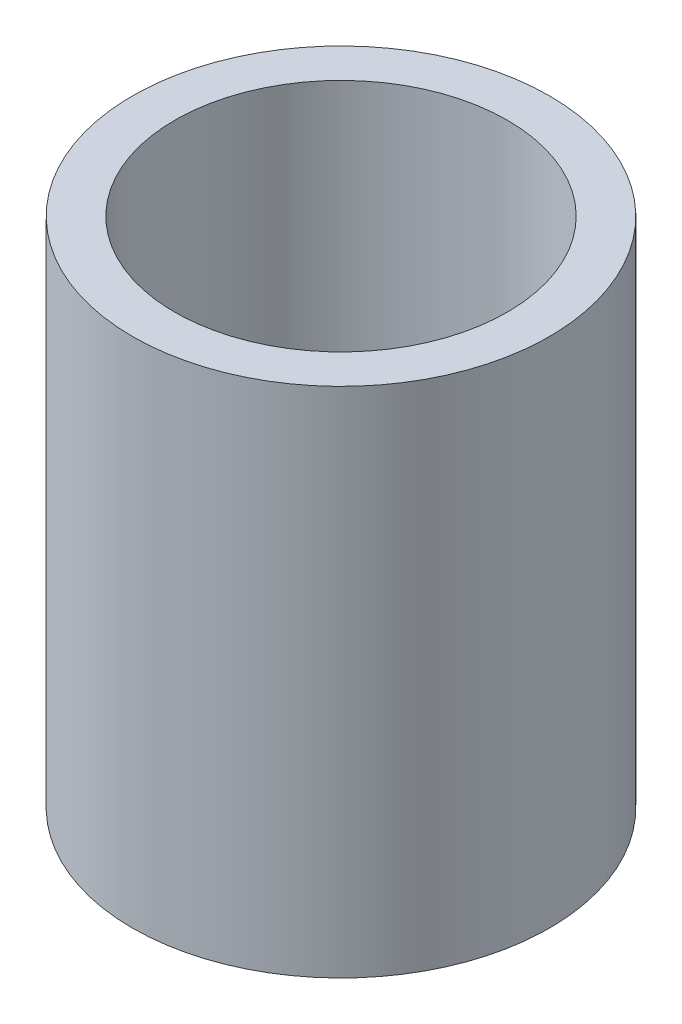
ISO-10303-21;
HEADER;
FILE_DESCRIPTION(('STEP AP214'),'2;1');
FILE_NAME('part.step','',(''),(''),'','','');
FILE_SCHEMA(('AUTOMOTIVE_DESIGN { 1 0 10303 214 1 1 1 1 }'));
ENDSEC;
DATA;
#1=APPLICATION_CONTEXT('core data for automotive mechanical design processes');
#2=APPLICATION_PROTOCOL_DEFINITION('international standard','automotive_design',2000,#1);
#3=PRODUCT_CONTEXT('',#1,'mechanical');
#4=PRODUCT('Part','Part','',(#3));
#5=PRODUCT_RELATED_PRODUCT_CATEGORY('part','',(#4));
#6=PRODUCT_DEFINITION_FORMATION('','',#4);
#7=PRODUCT_DEFINITION_CONTEXT('part definition',#1,'design');
#8=PRODUCT_DEFINITION('design','',#6,#7);
#9=PRODUCT_DEFINITION_SHAPE('','',#8);
#10=(LENGTH_UNIT() NAMED_UNIT(*) SI_UNIT(.MILLI.,.METRE.));
#11=(NAMED_UNIT(*) PLANE_ANGLE_UNIT() SI_UNIT($,.RADIAN.));
#12=(NAMED_UNIT(*) SI_UNIT($,.STERADIAN.) SOLID_ANGLE_UNIT());
#13=UNCERTAINTY_MEASURE_WITH_UNIT(LENGTH_MEASURE(1.E-05),#10,'distance_accuracy_value','');
#14=(GEOMETRIC_REPRESENTATION_CONTEXT(3) GLOBAL_UNCERTAINTY_ASSIGNED_CONTEXT((#13)) GLOBAL_UNIT_ASSIGNED_CONTEXT((#10,
#11,#12)) REPRESENTATION_CONTEXT('',''));
#15=CARTESIAN_POINT('',(0.,0.,0.));
#16=DIRECTION('',(0.,0.,1.));
#17=DIRECTION('',(1.,0.,0.));
#18=AXIS2_PLACEMENT_3D('',#15,#16,#17);
#19=CARTESIAN_POINT('',(0.,79.8807266640843,0.));
#20=DIRECTION('',(0.,-1.,0.));
#21=DIRECTION('',(0.,0.,-1.));
#22=AXIS2_PLACEMENT_3D('',#19,#20,#21);
#23=CYLINDRICAL_SURFACE('',#22,32.5);
#24=CARTESIAN_POINT('',(0.,79.8807266640843,0.));
#25=DIRECTION('',(0.,1.,0.));
#26=DIRECTION('',(0.,0.,1.));
#27=AXIS2_PLACEMENT_3D('',#24,#25,#26);
#28=CIRCLE('',#27,32.5);
#29=CARTESIAN_POINT('',(0.,79.8807266640843,-32.5));
#30=VERTEX_POINT('',#29);
#31=EDGE_CURVE('E10',#30,#30,#28,.T.);
#32=CARTESIAN_POINT('',(0.,0.,0.));
#33=DIRECTION('',(0.,1.,0.));
#34=DIRECTION('',(0.,0.,1.));
#35=AXIS2_PLACEMENT_3D('',#32,#33,#34);
#36=CIRCLE('',#35,32.5);
#37=CARTESIAN_POINT('',(0.,0.,-32.5));
#38=VERTEX_POINT('',#37);
#39=EDGE_CURVE('E37',#38,#38,#36,.T.);
#40=CARTESIAN_POINT('',(0.,79.8807266640843,-32.5));
#41=CARTESIAN_POINT('',(0.,79.0486357613334,-32.5));
#42=CARTESIAN_POINT('',(0.,78.2165448585826,-32.5));
#43=CARTESIAN_POINT('',(0.,76.5523630530808,-32.5));
#44=CARTESIAN_POINT('',(0.,75.7202721503299,-32.5));
#45=CARTESIAN_POINT('',(0.,74.0560903448282,-32.5));
#46=CARTESIAN_POINT('',(0.,73.2239994420773,-32.5));
#47=CARTESIAN_POINT('',(0.,71.5598176365755,-32.5));
#48=CARTESIAN_POINT('',(0.,70.7277267338247,-32.5));
#49=CARTESIAN_POINT('',(0.,69.0635449283229,-32.5));
#50=CARTESIAN_POINT('',(0.,68.231454025572,-32.5));
#51=CARTESIAN_POINT('',(0.,66.5672722200703,-32.5));
#52=CARTESIAN_POINT('',(0.,65.7351813173194,-32.5));
#53=CARTESIAN_POINT('',(0.,64.0709995118176,-32.5));
#54=CARTESIAN_POINT('',(0.,63.2389086090668,-32.5));
#55=CARTESIAN_POINT('',(0.,61.574726803565,-32.5));
#56=CARTESIAN_POINT('',(0.,60.7426359008141,-32.5));
#57=CARTESIAN_POINT('',(0.,59.0784540953124,-32.5));
#58=CARTESIAN_POINT('',(0.,58.2463631925615,-32.5));
#59=CARTESIAN_POINT('',(0.,56.5821813870597,-32.5));
#60=CARTESIAN_POINT('',(0.,55.7500904843088,-32.5));
#61=CARTESIAN_POINT('',(0.,54.0859086788071,-32.5));
#62=CARTESIAN_POINT('',(0.,53.2538177760562,-32.5));
#63=CARTESIAN_POINT('',(0.,51.5896359705545,-32.5));
#64=CARTESIAN_POINT('',(0.,50.7575450678036,-32.5));
#65=CARTESIAN_POINT('',(0.,49.0933632623018,-32.5));
#66=CARTESIAN_POINT('',(0.,48.2612723595509,-32.5));
#67=CARTESIAN_POINT('',(0.,46.5970905540492,-32.5));
#68=CARTESIAN_POINT('',(0.,45.7649996512983,-32.5));
#69=CARTESIAN_POINT('',(0.,44.1008178457965,-32.5));
#70=CARTESIAN_POINT('',(0.,43.2687269430457,-32.5));
#71=CARTESIAN_POINT('',(0.,41.6045451375439,-32.5));
#72=CARTESIAN_POINT('',(0.,40.772454234793,-32.5));
#73=CARTESIAN_POINT('',(0.,39.1082724292913,-32.5));
#74=CARTESIAN_POINT('',(0.,38.2761815265404,-32.5));
#75=CARTESIAN_POINT('',(0.,36.6119997210386,-32.5));
#76=CARTESIAN_POINT('',(0.,35.7799088182878,-32.5));
#77=CARTESIAN_POINT('',(0.,34.115727012786,-32.5));
#78=CARTESIAN_POINT('',(0.,33.2836361100351,-32.5));
#79=CARTESIAN_POINT('',(0.,31.6194543045334,-32.5));
#80=CARTESIAN_POINT('',(0.,30.7873634017825,-32.5));
#81=CARTESIAN_POINT('',(0.,29.1231815962807,-32.5));
#82=CARTESIAN_POINT('',(0.,28.2910906935299,-32.5));
#83=CARTESIAN_POINT('',(0.,26.6269088880281,-32.5));
#84=CARTESIAN_POINT('',(0.,25.7948179852772,-32.5));
#85=CARTESIAN_POINT('',(0.,24.1306361797755,-32.5));
#86=CARTESIAN_POINT('',(0.,23.2985452770246,-32.5));
#87=CARTESIAN_POINT('',(0.,21.6343634715228,-32.5));
#88=CARTESIAN_POINT('',(0.,20.802272568772,-32.5));
#89=CARTESIAN_POINT('',(0.,19.1380907632702,-32.5));
#90=CARTESIAN_POINT('',(0.,18.3059998605193,-32.5));
#91=CARTESIAN_POINT('',(0.,16.6418180550176,-32.5));
#92=CARTESIAN_POINT('',(0.,15.8097271522667,-32.5));
#93=CARTESIAN_POINT('',(0.,14.1455453467649,-32.5));
#94=CARTESIAN_POINT('',(0.,13.3134544440141,-32.5));
#95=CARTESIAN_POINT('',(0.,11.6492726385123,-32.5));
#96=CARTESIAN_POINT('',(0.,10.8171817357614,-32.5));
#97=CARTESIAN_POINT('',(0.,9.15299993025966,-32.5));
#98=CARTESIAN_POINT('',(0.,8.32090902750878,-32.5));
#99=CARTESIAN_POINT('',(0.,6.65672722200703,-32.5));
#100=CARTESIAN_POINT('',(0.,5.82463631925615,-32.5));
#101=CARTESIAN_POINT('',(0.,4.16045451375439,-32.5));
#102=CARTESIAN_POINT('',(0.,3.32836361100351,-32.5));
#103=CARTESIAN_POINT('',(0.,1.66418180550175,-32.5));
#104=CARTESIAN_POINT('',(0.,0.832090902750876,-32.5));
#105=CARTESIAN_POINT('',(0.,0.,-32.5));
#106=B_SPLINE_CURVE_WITH_KNOTS('',3,(#40,#41,#42,#43,#44,#45,#46,#47,#48,#49,#50,#51,#52,#53,
#54,#55,#56,#57,#58,#59,#60,#61,#62,#63,#64,#65,#66,#67,#68,#69,#70,#71,#72,#73,#74,#75,#76,#77,
#78,#79,#80,#81,#82,#83,#84,#85,#86,#87,#88,#89,#90,#91,#92,#93,#94,#95,#96,#97,#98,#99,#100,
#101,#102,#103,#104,#105),.UNSPECIFIED.,.F.,.F.,(4,2,2,2,2,2,2,2,2,2,2,2,2,2,2,2,2,2,2,2,2,2,2,
2,2,2,2,2,2,2,2,2,4),(0.,2.49627270825263,4.99254541650526,7.48881812475789,9.98509083301052,
12.4813635412632,14.9776362495158,17.4739089577684,19.9701816660211,22.4664543742737,
24.9627270825263,27.458999790779,29.9552724990316,32.4515452072842,34.9478179155369,
37.4440906237895,39.9403633320421,42.4366360402948,44.9329087485474,47.4291814568001,
49.9254541650527,52.4217268733053,54.917999581558,57.4142722898106,59.9105449980632,
62.4068177063159,64.9030904145685,67.3993631228211,69.8956358310738,72.3919085393264,
74.888181247579,77.3844539558317,79.8807266640843),.UNSPECIFIED.);
#107=EDGE_CURVE('BSEAM40',#30,#38,#106,.T.);
#108=ORIENTED_EDGE('',*,*,#31,.F.);
#109=ORIENTED_EDGE('',*,*,#39,.T.);
#110=ORIENTED_EDGE('',*,*,#107,.T.);
#111=ORIENTED_EDGE('',*,*,#107,.F.);
#112=EDGE_LOOP('',(#108,#110,#109,#111));
#113=FACE_BOUND('',#112,.T.);
#114=ADVANCED_FACE('F40',(#113),#23,.T.);
#115=CARTESIAN_POINT('',(0.,79.8807266640843,0.));
#116=DIRECTION('',(0.,1.,0.));
#117=DIRECTION('',(0.,0.,1.));
#118=AXIS2_PLACEMENT_3D('',#115,#116,#117);
#119=PLANE('',#118);
#120=CARTESIAN_POINT('',(0.,79.8807266640843,0.));
#121=DIRECTION('',(0.,1.,0.));
#122=DIRECTION('',(0.,0.,1.));
#123=AXIS2_PLACEMENT_3D('',#120,#121,#122);
#124=CIRCLE('',#123,25.9281304559299);
#125=CARTESIAN_POINT('',(0.,79.8807266640843,-25.9281304559299));
#126=VERTEX_POINT('',#125);
#127=EDGE_CURVE('E50',#126,#126,#124,.T.);
#128=ORIENTED_EDGE('',*,*,#127,.F.);
#129=EDGE_LOOP('',(#128));
#130=FACE_BOUND('',#129,.T.);
#131=ORIENTED_EDGE('',*,*,#31,.T.);
#132=EDGE_LOOP('',(#131));
#133=FACE_BOUND('',#132,.T.);
#134=ADVANCED_FACE('F59',(#130,#133),#119,.T.);
#135=CARTESIAN_POINT('',(0.,0.,0.));
#136=DIRECTION('',(0.,1.,0.));
#137=DIRECTION('',(0.,0.,1.));
#138=AXIS2_PLACEMENT_3D('',#135,#136,#137);
#139=PLANE('',#138);
#140=CARTESIAN_POINT('',(0.,0.,0.));
#141=DIRECTION('',(0.,1.,0.));
#142=DIRECTION('',(0.,0.,1.));
#143=AXIS2_PLACEMENT_3D('',#140,#141,#142);
#144=CIRCLE('',#143,25.9281304559299);
#145=CARTESIAN_POINT('',(0.,0.,-25.9281304559299));
#146=VERTEX_POINT('',#145);
#147=EDGE_CURVE('E47',#146,#146,#144,.T.);
#148=ORIENTED_EDGE('',*,*,#147,.T.);
#149=EDGE_LOOP('',(#148));
#150=FACE_BOUND('',#149,.T.);
#151=ORIENTED_EDGE('',*,*,#39,.F.);
#152=EDGE_LOOP('',(#151));
#153=FACE_BOUND('',#152,.T.);
#154=ADVANCED_FACE('F58',(#150,#153),#139,.F.);
#155=CARTESIAN_POINT('',(0.,79.8807266640843,0.));
#156=DIRECTION('',(0.,-1.,0.));
#157=DIRECTION('',(0.,0.,-1.));
#158=AXIS2_PLACEMENT_3D('',#155,#156,#157);
#159=CYLINDRICAL_SURFACE('',#158,25.9281304559299);
#160=CARTESIAN_POINT('',(0.,79.8807266640843,-25.9281304559299));
#161=CARTESIAN_POINT('',(0.,79.0486357613334,-25.9281304559299));
#162=CARTESIAN_POINT('',(0.,78.2165448585826,-25.9281304559299));
#163=CARTESIAN_POINT('',(0.,76.5523630530808,-25.9281304559299));
#164=CARTESIAN_POINT('',(0.,75.7202721503299,-25.9281304559299));
#165=CARTESIAN_POINT('',(0.,74.0560903448282,-25.9281304559299));
#166=CARTESIAN_POINT('',(0.,73.2239994420773,-25.9281304559299));
#167=CARTESIAN_POINT('',(0.,71.5598176365755,-25.9281304559299));
#168=CARTESIAN_POINT('',(0.,70.7277267338246,-25.9281304559299));
#169=CARTESIAN_POINT('',(0.,69.0635449283229,-25.9281304559299));
#170=CARTESIAN_POINT('',(0.,68.231454025572,-25.9281304559299));
#171=CARTESIAN_POINT('',(0.,66.5672722200703,-25.9281304559299));
#172=CARTESIAN_POINT('',(0.,65.7351813173194,-25.9281304559299));
#173=CARTESIAN_POINT('',(0.,64.0709995118176,-25.9281304559299));
#174=CARTESIAN_POINT('',(0.,63.2389086090667,-25.9281304559299));
#175=CARTESIAN_POINT('',(0.,61.574726803565,-25.9281304559299));
#176=CARTESIAN_POINT('',(0.,60.7426359008141,-25.9281304559299));
#177=CARTESIAN_POINT('',(0.,59.0784540953124,-25.9281304559299));
#178=CARTESIAN_POINT('',(0.,58.2463631925615,-25.9281304559299));
#179=CARTESIAN_POINT('',(0.,56.5821813870597,-25.9281304559299));
#180=CARTESIAN_POINT('',(0.,55.7500904843088,-25.9281304559299));
#181=CARTESIAN_POINT('',(0.,54.0859086788071,-25.9281304559299));
#182=CARTESIAN_POINT('',(0.,53.2538177760562,-25.9281304559299));
#183=CARTESIAN_POINT('',(0.,51.5896359705544,-25.9281304559299));
#184=CARTESIAN_POINT('',(0.,50.7575450678036,-25.9281304559299));
#185=CARTESIAN_POINT('',(0.,49.0933632623018,-25.9281304559299));
#186=CARTESIAN_POINT('',(0.,48.2612723595509,-25.9281304559299));
#187=CARTESIAN_POINT('',(0.,46.5970905540492,-25.9281304559299));
#188=CARTESIAN_POINT('',(0.,45.7649996512983,-25.9281304559299));
#189=CARTESIAN_POINT('',(0.,44.1008178457965,-25.9281304559299));
#190=CARTESIAN_POINT('',(0.,43.2687269430457,-25.9281304559299));
#191=CARTESIAN_POINT('',(0.,41.6045451375439,-25.9281304559299));
#192=CARTESIAN_POINT('',(0.,40.772454234793,-25.9281304559299));
#193=CARTESIAN_POINT('',(0.,39.1082724292913,-25.9281304559299));
#194=CARTESIAN_POINT('',(0.,38.2761815265404,-25.9281304559299));
#195=CARTESIAN_POINT('',(0.,36.6119997210386,-25.9281304559299));
#196=CARTESIAN_POINT('',(0.,35.7799088182878,-25.9281304559299));
#197=CARTESIAN_POINT('',(0.,34.115727012786,-25.9281304559299));
#198=CARTESIAN_POINT('',(0.,33.2836361100351,-25.9281304559299));
#199=CARTESIAN_POINT('',(0.,31.6194543045334,-25.9281304559299));
#200=CARTESIAN_POINT('',(0.,30.7873634017825,-25.9281304559299));
#201=CARTESIAN_POINT('',(0.,29.1231815962807,-25.9281304559299));
#202=CARTESIAN_POINT('',(0.,28.2910906935299,-25.9281304559299));
#203=CARTESIAN_POINT('',(0.,26.6269088880281,-25.9281304559299));
#204=CARTESIAN_POINT('',(0.,25.7948179852772,-25.9281304559299));
#205=CARTESIAN_POINT('',(0.,24.1306361797755,-25.9281304559299));
#206=CARTESIAN_POINT('',(0.,23.2985452770246,-25.9281304559299));
#207=CARTESIAN_POINT('',(0.,21.6343634715228,-25.9281304559299));
#208=CARTESIAN_POINT('',(0.,20.8022725687719,-25.9281304559299));
#209=CARTESIAN_POINT('',(0.,19.1380907632702,-25.9281304559299));
#210=CARTESIAN_POINT('',(0.,18.3059998605193,-25.9281304559299));
#211=CARTESIAN_POINT('',(0.,16.6418180550176,-25.9281304559299));
#212=CARTESIAN_POINT('',(0.,15.8097271522667,-25.9281304559299));
#213=CARTESIAN_POINT('',(0.,14.1455453467649,-25.9281304559299));
#214=CARTESIAN_POINT('',(0.,13.3134544440141,-25.9281304559299));
#215=CARTESIAN_POINT('',(0.,11.6492726385123,-25.9281304559299));
#216=CARTESIAN_POINT('',(0.,10.8171817357614,-25.9281304559299));
#217=CARTESIAN_POINT('',(0.,9.15299993025966,-25.9281304559299));
#218=CARTESIAN_POINT('',(0.,8.32090902750878,-25.9281304559299));
#219=CARTESIAN_POINT('',(0.,6.65672722200703,-25.9281304559299));
#220=CARTESIAN_POINT('',(0.,5.82463631925615,-25.9281304559299));
#221=CARTESIAN_POINT('',(0.,4.16045451375439,-25.9281304559299));
#222=CARTESIAN_POINT('',(0.,3.32836361100351,-25.9281304559299));
#223=CARTESIAN_POINT('',(0.,1.66418180550175,-25.9281304559299));
#224=CARTESIAN_POINT('',(0.,0.832090902750876,-25.9281304559299));
#225=CARTESIAN_POINT('',(0.,0.,-25.9281304559299));
#226=B_SPLINE_CURVE_WITH_KNOTS('',3,(#160,#161,#162,#163,#164,#165,#166,#167,#168,#169,#170,
#171,#172,#173,#174,#175,#176,#177,#178,#179,#180,#181,#182,#183,#184,#185,#186,#187,#188,#189,
#190,#191,#192,#193,#194,#195,#196,#197,#198,#199,#200,#201,#202,#203,#204,#205,#206,#207,#208,
#209,#210,#211,#212,#213,#214,#215,#216,#217,#218,#219,#220,#221,#222,#223,#224,#225),
.UNSPECIFIED.,.F.,.F.,(4,2,2,2,2,2,2,2,2,2,2,2,2,2,2,2,2,2,2,2,2,2,2,2,2,2,2,2,2,2,2,2,4),(0.,
2.49627270825264,4.99254541650528,7.48881812475791,9.98509083301055,12.4813635412632,
14.9776362495158,17.4739089577685,19.9701816660211,22.4664543742737,24.9627270825263,
27.458999790779,29.9552724990316,32.4515452072843,34.9478179155369,37.4440906237895,
39.9403633320422,42.4366360402948,44.9329087485474,47.4291814568001,49.9254541650527,
52.4217268733053,54.917999581558,57.4142722898106,59.9105449980632,62.4068177063159,
64.9030904145685,67.3993631228211,69.8956358310738,72.3919085393264,74.888181247579,
77.3844539558317,79.8807266640843),.UNSPECIFIED.);
#227=EDGE_CURVE('BSEAM54',#126,#146,#226,.T.);
#228=ORIENTED_EDGE('',*,*,#127,.T.);
#229=ORIENTED_EDGE('',*,*,#147,.F.);
#230=ORIENTED_EDGE('',*,*,#227,.T.);
#231=ORIENTED_EDGE('',*,*,#227,.F.);
#232=EDGE_LOOP('',(#228,#230,#229,#231));
#233=FACE_BOUND('',#232,.T.);
#234=ADVANCED_FACE('F54',(#233),#159,.F.);
#235=CLOSED_SHELL('',(#114,#134,#154,#234));
#236=MANIFOLD_SOLID_BREP('B2',#235);
#237=ADVANCED_BREP_SHAPE_REPRESENTATION('',(#18,#236),#14);
#238=SHAPE_DEFINITION_REPRESENTATION(#9,#237);
ENDSEC;
END-ISO-10303-21;
